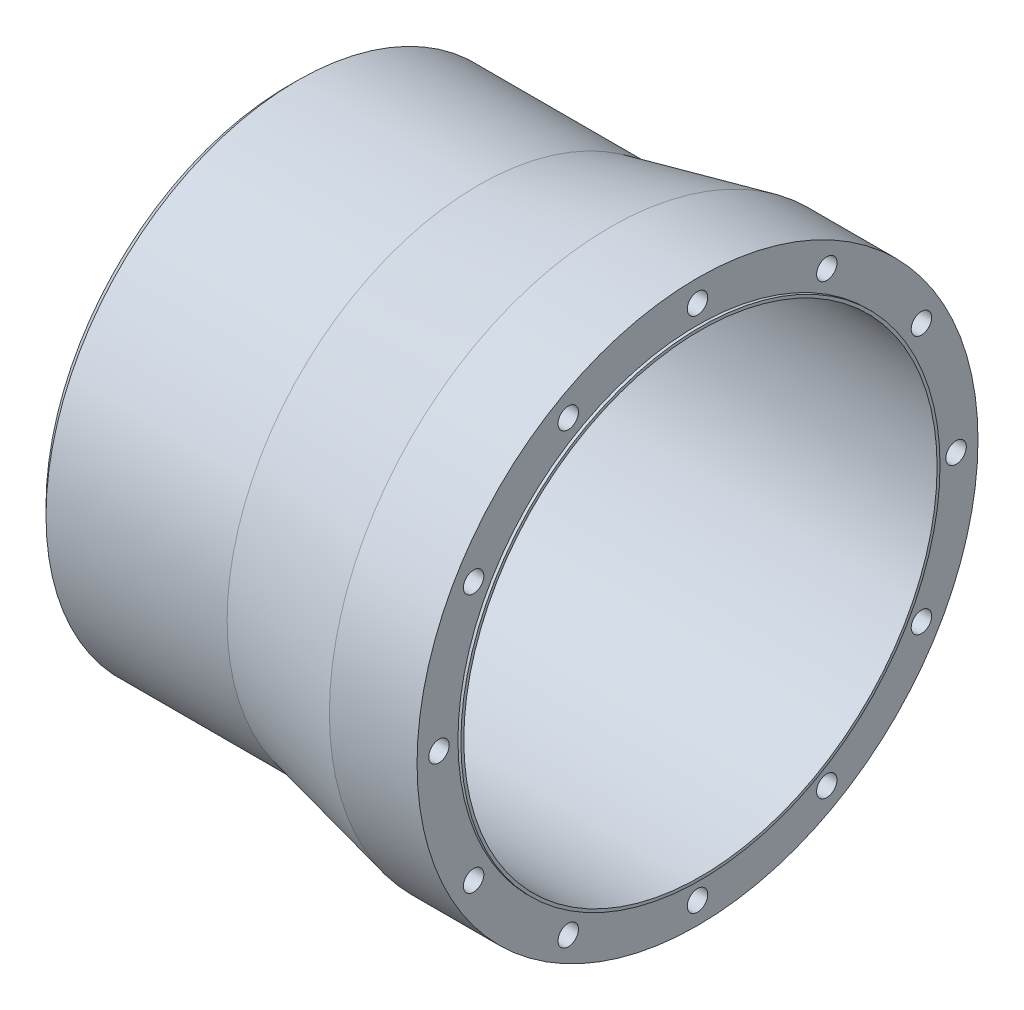
ISO-10303-21;
HEADER;
FILE_DESCRIPTION(('STEP AP214'),'2;1');
FILE_NAME('part.step','',(''),(''),'','','');
FILE_SCHEMA(('AUTOMOTIVE_DESIGN { 1 0 10303 214 1 1 1 1 }'));
ENDSEC;
DATA;
#1=APPLICATION_CONTEXT('core data for automotive mechanical design processes');
#2=APPLICATION_PROTOCOL_DEFINITION('international standard','automotive_design',2000,#1);
#3=PRODUCT_CONTEXT('',#1,'mechanical');
#4=PRODUCT('Part','Part','',(#3));
#5=PRODUCT_RELATED_PRODUCT_CATEGORY('part','',(#4));
#6=PRODUCT_DEFINITION_FORMATION('','',#4);
#7=PRODUCT_DEFINITION_CONTEXT('part definition',#1,'design');
#8=PRODUCT_DEFINITION('design','',#6,#7);
#9=PRODUCT_DEFINITION_SHAPE('','',#8);
#10=(LENGTH_UNIT() NAMED_UNIT(*) SI_UNIT(.MILLI.,.METRE.));
#11=(NAMED_UNIT(*) PLANE_ANGLE_UNIT() SI_UNIT($,.RADIAN.));
#12=(NAMED_UNIT(*) SI_UNIT($,.STERADIAN.) SOLID_ANGLE_UNIT());
#13=UNCERTAINTY_MEASURE_WITH_UNIT(LENGTH_MEASURE(1.E-05),#10,'distance_accuracy_value','');
#14=(GEOMETRIC_REPRESENTATION_CONTEXT(3) GLOBAL_UNCERTAINTY_ASSIGNED_CONTEXT((#13)) GLOBAL_UNIT_ASSIGNED_CONTEXT((#10,
#11,#12)) REPRESENTATION_CONTEXT('',''));
#15=CARTESIAN_POINT('',(0.,0.,0.));
#16=DIRECTION('',(0.,0.,1.));
#17=DIRECTION('',(1.,0.,0.));
#18=AXIS2_PLACEMENT_3D('',#15,#16,#17);
#19=CARTESIAN_POINT('',(150.,86.,0.));
#20=DIRECTION('',(-1.,0.,0.));
#21=DIRECTION('',(0.,0.,1.));
#22=AXIS2_PLACEMENT_3D('',#19,#20,#21);
#23=PLANE('',#22);
#24=CARTESIAN_POINT('',(150.,0.,0.));
#25=DIRECTION('',(-1.,0.,0.));
#26=DIRECTION('',(0.,0.,1.));
#27=AXIS2_PLACEMENT_3D('',#24,#25,#26);
#28=CIRCLE('',#27,96.);
#29=CARTESIAN_POINT('',(150.,0.,96.));
#30=VERTEX_POINT('',#29);
#31=EDGE_CURVE('E49',#30,#30,#28,.T.);
#32=ORIENTED_EDGE('',*,*,#31,.F.);
#33=EDGE_LOOP('',(#32));
#34=FACE_BOUND('',#33,.T.);
#35=CARTESIAN_POINT('',(150.,76.6432482349291,-44.2500000000017));
#36=DIRECTION('',(1.,0.,0.));
#37=DIRECTION('',(0.,0.,-1.));
#38=AXIS2_PLACEMENT_3D('',#35,#36,#37);
#39=CIRCLE('',#38,3.49999999999987);
#40=CARTESIAN_POINT('',(150.,76.6432482349291,-47.7500000000016));
#41=VERTEX_POINT('',#40);
#42=EDGE_CURVE('E64',#41,#41,#39,.T.);
#43=ORIENTED_EDGE('',*,*,#42,.F.);
#44=EDGE_LOOP('',(#43));
#45=FACE_BOUND('',#44,.T.);
#46=CARTESIAN_POINT('',(150.,88.5,0.));
#47=DIRECTION('',(1.,0.,0.));
#48=DIRECTION('',(0.,0.,-1.));
#49=AXIS2_PLACEMENT_3D('',#46,#47,#48);
#50=CIRCLE('',#49,3.5);
#51=CARTESIAN_POINT('',(150.,88.5,-3.5));
#52=VERTEX_POINT('',#51);
#53=EDGE_CURVE('E95',#52,#52,#50,.T.);
#54=ORIENTED_EDGE('',*,*,#53,.F.);
#55=EDGE_LOOP('',(#54));
#56=FACE_BOUND('',#55,.T.);
#57=CARTESIAN_POINT('',(150.,44.2500000000109,-76.6432482349291));
#58=DIRECTION('',(1.,0.,0.));
#59=DIRECTION('',(0.,0.,-1.));
#60=AXIS2_PLACEMENT_3D('',#57,#58,#59);
#61=CIRCLE('',#60,3.50000000000303);
#62=CARTESIAN_POINT('',(150.,44.2500000000109,-80.1432482349321));
#63=VERTEX_POINT('',#62);
#64=EDGE_CURVE('E89',#63,#63,#61,.T.);
#65=ORIENTED_EDGE('',*,*,#64,.F.);
#66=EDGE_LOOP('',(#65));
#67=FACE_BOUND('',#66,.T.);
#68=CARTESIAN_POINT('',(150.,1.25657682987813E-11,-88.5000000000125));
#69=DIRECTION('',(1.,0.,0.));
#70=DIRECTION('',(0.,0.,-1.));
#71=AXIS2_PLACEMENT_3D('',#68,#69,#70);
#72=CIRCLE('',#71,3.50000000000864);
#73=CARTESIAN_POINT('',(150.,1.25657682987813E-11,-92.0000000000212));
#74=VERTEX_POINT('',#73);
#75=EDGE_CURVE('E83',#74,#74,#72,.T.);
#76=ORIENTED_EDGE('',*,*,#75,.F.);
#77=EDGE_LOOP('',(#76));
#78=FACE_BOUND('',#77,.T.);
#79=CARTESIAN_POINT('',(150.,-44.2499999999891,-76.6432482349417));
#80=DIRECTION('',(1.,0.,0.));
#81=DIRECTION('',(0.,0.,-1.));
#82=AXIS2_PLACEMENT_3D('',#79,#80,#81);
#83=CIRCLE('',#82,3.50000000001525);
#84=CARTESIAN_POINT('',(150.,-44.2499999999891,-80.1432482349569));
#85=VERTEX_POINT('',#84);
#86=EDGE_CURVE('E77',#85,#85,#83,.T.);
#87=ORIENTED_EDGE('',*,*,#86,.F.);
#88=EDGE_LOOP('',(#87));
#89=FACE_BOUND('',#88,.T.);
#90=CARTESIAN_POINT('',(150.,-76.6432482349165,-44.2500000000235));
#91=DIRECTION('',(1.,0.,0.));
#92=DIRECTION('',(0.,0.,-1.));
#93=AXIS2_PLACEMENT_3D('',#90,#91,#92);
#94=CIRCLE('',#93,3.50000000002111);
#95=CARTESIAN_POINT('',(150.,-76.6432482349165,-47.7500000000446));
#96=VERTEX_POINT('',#95);
#97=EDGE_CURVE('E70',#96,#96,#94,.T.);
#98=ORIENTED_EDGE('',*,*,#97,.F.);
#99=EDGE_LOOP('',(#98));
#100=FACE_BOUND('',#99,.T.);
#101=CARTESIAN_POINT('',(150.,-88.5,-2.51315365975626E-11));
#102=DIRECTION('',(1.,0.,0.));
#103=DIRECTION('',(0.,0.,-1.));
#104=AXIS2_PLACEMENT_3D('',#101,#102,#103);
#105=CIRCLE('',#104,3.50000000002462);
#106=CARTESIAN_POINT('',(150.,-88.5,-3.50000000004975));
#107=VERTEX_POINT('',#106);
#108=EDGE_CURVE('E131',#107,#107,#105,.T.);
#109=ORIENTED_EDGE('',*,*,#108,.F.);
#110=EDGE_LOOP('',(#109));
#111=FACE_BOUND('',#110,.T.);
#112=CARTESIAN_POINT('',(150.,-76.6432482349291,44.2499999999765));
#113=DIRECTION('',(1.,0.,0.));
#114=DIRECTION('',(0.,0.,-1.));
#115=AXIS2_PLACEMENT_3D('',#112,#113,#114);
#116=CIRCLE('',#115,3.50000000002497);
#117=CARTESIAN_POINT('',(150.,-76.6432482349291,40.7499999999516));
#118=VERTEX_POINT('',#117);
#119=EDGE_CURVE('E125',#118,#118,#116,.T.);
#120=ORIENTED_EDGE('',*,*,#119,.F.);
#121=EDGE_LOOP('',(#120));
#122=FACE_BOUND('',#121,.T.);
#123=CARTESIAN_POINT('',(150.,-44.2500000000109,76.6432482349039));
#124=DIRECTION('',(1.,0.,0.));
#125=DIRECTION('',(0.,0.,-1.));
#126=AXIS2_PLACEMENT_3D('',#123,#124,#125);
#127=CIRCLE('',#126,3.50000000002204);
#128=CARTESIAN_POINT('',(150.,-44.2500000000109,73.1432482348819));
#129=VERTEX_POINT('',#128);
#130=EDGE_CURVE('E119',#129,#129,#127,.T.);
#131=ORIENTED_EDGE('',*,*,#130,.F.);
#132=EDGE_LOOP('',(#131));
#133=FACE_BOUND('',#132,.T.);
#134=CARTESIAN_POINT('',(150.,-1.25766064229538E-11,88.4999999999874));
#135=DIRECTION('',(1.,0.,0.));
#136=DIRECTION('',(0.,0.,-1.));
#137=AXIS2_PLACEMENT_3D('',#134,#135,#136);
#138=CIRCLE('',#137,3.50000000001658);
#139=CARTESIAN_POINT('',(150.,-1.25766064229538E-11,84.9999999999709));
#140=VERTEX_POINT('',#139);
#141=EDGE_CURVE('E113',#140,#140,#138,.T.);
#142=ORIENTED_EDGE('',*,*,#141,.F.);
#143=EDGE_LOOP('',(#142));
#144=FACE_BOUND('',#143,.T.);
#145=CARTESIAN_POINT('',(150.,44.2499999999891,76.6432482349166));
#146=DIRECTION('',(1.,0.,0.));
#147=DIRECTION('',(0.,0.,-1.));
#148=AXIS2_PLACEMENT_3D('',#145,#146,#147);
#149=CIRCLE('',#148,3.50000000001025);
#150=CARTESIAN_POINT('',(150.,44.2499999999891,73.1432482349063));
#151=VERTEX_POINT('',#150);
#152=EDGE_CURVE('E107',#151,#151,#149,.T.);
#153=ORIENTED_EDGE('',*,*,#152,.F.);
#154=EDGE_LOOP('',(#153));
#155=FACE_BOUND('',#154,.T.);
#156=CARTESIAN_POINT('',(150.,76.6432482349165,44.2499999999984));
#157=DIRECTION('',(1.,0.,0.));
#158=DIRECTION('',(0.,0.,-1.));
#159=AXIS2_PLACEMENT_3D('',#156,#157,#158);
#160=CIRCLE('',#159,3.50000000000459);
#161=CARTESIAN_POINT('',(150.,76.6432482349165,40.7499999999938));
#162=VERTEX_POINT('',#161);
#163=EDGE_CURVE('E100',#162,#162,#160,.T.);
#164=ORIENTED_EDGE('',*,*,#163,.F.);
#165=EDGE_LOOP('',(#164));
#166=FACE_BOUND('',#165,.T.);
#167=CARTESIAN_POINT('',(150.,0.,0.));
#168=DIRECTION('',(-1.,0.,0.));
#169=DIRECTION('',(0.,0.,1.));
#170=AXIS2_PLACEMENT_3D('',#167,#168,#169);
#171=CIRCLE('',#170,82.);
#172=CARTESIAN_POINT('',(150.,0.,82.));
#173=VERTEX_POINT('',#172);
#174=EDGE_CURVE('E10',#173,#173,#171,.F.);
#175=ORIENTED_EDGE('',*,*,#174,.F.);
#176=EDGE_LOOP('',(#175));
#177=FACE_BOUND('',#176,.T.);
#178=ADVANCED_FACE('F34',(#34,#45,#56,#67,#78,#89,#100,#111,#122,#133,#144,#155,#166,#177),#23,.F.);
#179=CARTESIAN_POINT('',(0.,0.,0.));
#180=DIRECTION('',(-1.,0.,0.));
#181=DIRECTION('',(0.,0.,1.));
#182=AXIS2_PLACEMENT_3D('',#179,#180,#181);
#183=CYLINDRICAL_SURFACE('',#182,96.);
#184=CARTESIAN_POINT('',(120.,0.,0.));
#185=DIRECTION('',(-1.,0.,0.));
#186=DIRECTION('',(0.,0.,1.));
#187=AXIS2_PLACEMENT_3D('',#184,#185,#186);
#188=CIRCLE('',#187,96.);
#189=CARTESIAN_POINT('',(120.,0.,96.));
#190=VERTEX_POINT('',#189);
#191=EDGE_CURVE('E54',#190,#190,#188,.T.);
#192=ORIENTED_EDGE('',*,*,#191,.F.);
#193=EDGE_LOOP('',(#192));
#194=FACE_BOUND('',#193,.T.);
#195=ORIENTED_EDGE('',*,*,#31,.T.);
#196=EDGE_LOOP('',(#195));
#197=FACE_BOUND('',#196,.T.);
#198=ADVANCED_FACE('F160',(#194,#197),#183,.T.);
#199=CARTESIAN_POINT('',(120.,0.,0.));
#200=DIRECTION('',(1.,0.,0.));
#201=DIRECTION('',(0.,0.,-1.));
#202=AXIS2_PLACEMENT_3D('',#199,#200,#201);
#203=CONICAL_SURFACE('',#202,96.,0.218668945873942);
#204=CARTESIAN_POINT('',(75.,0.,0.));
#205=DIRECTION('',(-1.,0.,0.));
#206=DIRECTION('',(0.,0.,1.));
#207=AXIS2_PLACEMENT_3D('',#204,#205,#206);
#208=CIRCLE('',#207,86.);
#209=CARTESIAN_POINT('',(75.,0.,86.));
#210=VERTEX_POINT('',#209);
#211=EDGE_CURVE('E57',#210,#210,#208,.T.);
#212=ORIENTED_EDGE('',*,*,#211,.F.);
#213=EDGE_LOOP('',(#212));
#214=FACE_BOUND('',#213,.T.);
#215=ORIENTED_EDGE('',*,*,#191,.T.);
#216=EDGE_LOOP('',(#215));
#217=FACE_BOUND('',#216,.T.);
#218=ADVANCED_FACE('F165',(#214,#217),#203,.T.);
#219=CARTESIAN_POINT('',(0.,0.,0.));
#220=DIRECTION('',(-1.,0.,0.));
#221=DIRECTION('',(0.,0.,1.));
#222=AXIS2_PLACEMENT_3D('',#219,#220,#221);
#223=CYLINDRICAL_SURFACE('',#222,86.);
#224=CARTESIAN_POINT('',(13.,0.,0.));
#225=DIRECTION('',(1.,0.,0.));
#226=DIRECTION('',(0.,0.,-1.));
#227=AXIS2_PLACEMENT_3D('',#224,#225,#226);
#228=CIRCLE('',#227,86.);
#229=CARTESIAN_POINT('',(13.,0.,-86.));
#230=VERTEX_POINT('',#229);
#231=EDGE_CURVE('E41',#230,#230,#228,.T.);
#232=ORIENTED_EDGE('',*,*,#231,.T.);
#233=EDGE_LOOP('',(#232));
#234=FACE_BOUND('',#233,.T.);
#235=ORIENTED_EDGE('',*,*,#211,.T.);
#236=EDGE_LOOP('',(#235));
#237=FACE_BOUND('',#236,.T.);
#238=ADVANCED_FACE('F173',(#234,#237),#223,.T.);
#239=CARTESIAN_POINT('',(10.,81.,0.));
#240=DIRECTION('',(1.,0.,0.));
#241=DIRECTION('',(0.,0.,-1.));
#242=AXIS2_PLACEMENT_3D('',#239,#240,#241);
#243=PLANE('',#242);
#244=CARTESIAN_POINT('',(10.,0.,0.));
#245=DIRECTION('',(1.,0.,0.));
#246=DIRECTION('',(0.,0.,-1.));
#247=AXIS2_PLACEMENT_3D('',#244,#245,#246);
#248=CIRCLE('',#247,83.);
#249=CARTESIAN_POINT('',(10.,0.,-83.));
#250=VERTEX_POINT('',#249);
#251=EDGE_CURVE('E45',#250,#250,#248,.F.);
#252=ORIENTED_EDGE('',*,*,#251,.T.);
#253=EDGE_LOOP('',(#252));
#254=FACE_BOUND('',#253,.T.);
#255=CARTESIAN_POINT('',(10.,0.,0.));
#256=DIRECTION('',(-1.,0.,0.));
#257=DIRECTION('',(0.,0.,1.));
#258=AXIS2_PLACEMENT_3D('',#255,#256,#257);
#259=CIRCLE('',#258,81.);
#260=CARTESIAN_POINT('',(10.,0.,81.));
#261=VERTEX_POINT('',#260);
#262=EDGE_CURVE('E60',#261,#261,#259,.T.);
#263=ORIENTED_EDGE('',*,*,#262,.F.);
#264=EDGE_LOOP('',(#263));
#265=FACE_BOUND('',#264,.T.);
#266=ADVANCED_FACE('F177',(#254,#265),#243,.F.);
#267=CARTESIAN_POINT('',(0.,0.,0.));
#268=DIRECTION('',(-1.,0.,0.));
#269=DIRECTION('',(0.,0.,1.));
#270=AXIS2_PLACEMENT_3D('',#267,#268,#269);
#271=CYLINDRICAL_SURFACE('',#270,81.);
#272=ORIENTED_EDGE('',*,*,#262,.T.);
#273=EDGE_LOOP('',(#272));
#274=FACE_BOUND('',#273,.T.);
#275=CARTESIAN_POINT('',(151.,0.,0.));
#276=DIRECTION('',(1.,0.,0.));
#277=DIRECTION('',(0.,0.,-1.));
#278=AXIS2_PLACEMENT_3D('',#275,#276,#277);
#279=CIRCLE('',#278,81.);
#280=CARTESIAN_POINT('',(151.,0.,-81.));
#281=VERTEX_POINT('',#280);
#282=EDGE_CURVE('E138',#281,#281,#279,.T.);
#283=ORIENTED_EDGE('',*,*,#282,.T.);
#284=EDGE_LOOP('',(#283));
#285=FACE_BOUND('',#284,.T.);
#286=ADVANCED_FACE('F142',(#274,#285),#271,.F.);
#287=CARTESIAN_POINT('',(10.,0.,0.));
#288=DIRECTION('',(1.,0.,0.));
#289=DIRECTION('',(0.,0.,-1.));
#290=AXIS2_PLACEMENT_3D('',#287,#288,#289);
#291=CONICAL_SURFACE('',#290,83.,0.785398163397446);
#292=CARTESIAN_POINT('',(13.,0.,-86.));
#293=CARTESIAN_POINT('',(12.96875,0.,-85.96875));
#294=CARTESIAN_POINT('',(12.9375,0.,-85.9375));
#295=CARTESIAN_POINT('',(12.875,0.,-85.875));
#296=CARTESIAN_POINT('',(12.84375,0.,-85.84375));
#297=CARTESIAN_POINT('',(12.78125,0.,-85.78125));
#298=CARTESIAN_POINT('',(12.75,0.,-85.75));
#299=CARTESIAN_POINT('',(12.6875,0.,-85.6875));
#300=CARTESIAN_POINT('',(12.65625,0.,-85.65625));
#301=CARTESIAN_POINT('',(12.59375,0.,-85.59375));
#302=CARTESIAN_POINT('',(12.5625,0.,-85.5625));
#303=CARTESIAN_POINT('',(12.5,0.,-85.5));
#304=CARTESIAN_POINT('',(12.46875,0.,-85.46875));
#305=CARTESIAN_POINT('',(12.40625,0.,-85.40625));
#306=CARTESIAN_POINT('',(12.375,0.,-85.375));
#307=CARTESIAN_POINT('',(12.3125,0.,-85.3125));
#308=CARTESIAN_POINT('',(12.28125,0.,-85.28125));
#309=CARTESIAN_POINT('',(12.21875,0.,-85.21875));
#310=CARTESIAN_POINT('',(12.1875,0.,-85.1875));
#311=CARTESIAN_POINT('',(12.125,0.,-85.125));
#312=CARTESIAN_POINT('',(12.09375,0.,-85.09375));
#313=CARTESIAN_POINT('',(12.03125,0.,-85.03125));
#314=CARTESIAN_POINT('',(12.,0.,-85.));
#315=CARTESIAN_POINT('',(11.9375,0.,-84.9375));
#316=CARTESIAN_POINT('',(11.90625,0.,-84.90625));
#317=CARTESIAN_POINT('',(11.84375,0.,-84.84375));
#318=CARTESIAN_POINT('',(11.8125,0.,-84.8125));
#319=CARTESIAN_POINT('',(11.75,0.,-84.75));
#320=CARTESIAN_POINT('',(11.71875,0.,-84.71875));
#321=CARTESIAN_POINT('',(11.65625,0.,-84.65625));
#322=CARTESIAN_POINT('',(11.625,0.,-84.625));
#323=CARTESIAN_POINT('',(11.5625,0.,-84.5625));
#324=CARTESIAN_POINT('',(11.53125,0.,-84.53125));
#325=CARTESIAN_POINT('',(11.46875,0.,-84.46875));
#326=CARTESIAN_POINT('',(11.4375,0.,-84.4375));
#327=CARTESIAN_POINT('',(11.375,0.,-84.375));
#328=CARTESIAN_POINT('',(11.34375,0.,-84.34375));
#329=CARTESIAN_POINT('',(11.28125,0.,-84.28125));
#330=CARTESIAN_POINT('',(11.25,0.,-84.25));
#331=CARTESIAN_POINT('',(11.1875,0.,-84.1875));
#332=CARTESIAN_POINT('',(11.15625,0.,-84.15625));
#333=CARTESIAN_POINT('',(11.09375,0.,-84.09375));
#334=CARTESIAN_POINT('',(11.0625,0.,-84.0625));
#335=CARTESIAN_POINT('',(11.,0.,-84.));
#336=CARTESIAN_POINT('',(10.96875,0.,-83.96875));
#337=CARTESIAN_POINT('',(10.90625,0.,-83.90625));
#338=CARTESIAN_POINT('',(10.875,0.,-83.875));
#339=CARTESIAN_POINT('',(10.8125,0.,-83.8125));
#340=CARTESIAN_POINT('',(10.78125,0.,-83.78125));
#341=CARTESIAN_POINT('',(10.71875,0.,-83.71875));
#342=CARTESIAN_POINT('',(10.6875,0.,-83.6875));
#343=CARTESIAN_POINT('',(10.625,0.,-83.625));
#344=CARTESIAN_POINT('',(10.59375,0.,-83.59375));
#345=CARTESIAN_POINT('',(10.53125,0.,-83.53125));
#346=CARTESIAN_POINT('',(10.5,0.,-83.5));
#347=CARTESIAN_POINT('',(10.4375,0.,-83.4375));
#348=CARTESIAN_POINT('',(10.40625,0.,-83.40625));
#349=CARTESIAN_POINT('',(10.34375,0.,-83.3437500000001));
#350=CARTESIAN_POINT('',(10.3125,0.,-83.3125));
#351=CARTESIAN_POINT('',(10.25,0.,-83.25));
#352=CARTESIAN_POINT('',(10.21875,0.,-83.21875));
#353=CARTESIAN_POINT('',(10.15625,0.,-83.15625));
#354=CARTESIAN_POINT('',(10.125,0.,-83.125));
#355=CARTESIAN_POINT('',(10.0625,0.,-83.0625000000001));
#356=CARTESIAN_POINT('',(10.03125,0.,-83.0312500000001));
#357=CARTESIAN_POINT('',(10.,0.,-83.));
#358=B_SPLINE_CURVE_WITH_KNOTS('',3,(#292,#293,#294,#295,#296,#297,#298,#299,#300,#301,#302,
#303,#304,#305,#306,#307,#308,#309,#310,#311,#312,#313,#314,#315,#316,#317,#318,#319,#320,#321,
#322,#323,#324,#325,#326,#327,#328,#329,#330,#331,#332,#333,#334,#335,#336,#337,#338,#339,#340,
#341,#342,#343,#344,#345,#346,#347,#348,#349,#350,#351,#352,#353,#354,#355,#356,#357),
.UNSPECIFIED.,.F.,.F.,(4,2,2,2,2,2,2,2,2,2,2,2,2,2,2,2,2,2,2,2,2,2,2,2,2,2,2,2,2,2,2,2,4),(0.,
0.13258252147248,0.265165042944949,0.39774756441743,0.530330085889909,0.662912607362379,
0.795495128834858,0.928077650307338,1.06066017177981,1.19324269325229,1.32582521472477,
1.45840773619724,1.59099025766972,1.7235727791422,1.85615530061467,1.98873782208715,
2.12132034355962,2.25390286503209,2.38648538650457,2.51906790797704,2.65165042944952,
2.784232950922,2.91681547239447,3.04939799386695,3.18198051533943,3.3145630368119,
3.44714555828438,3.57972807975686,3.71231060122933,3.84489312270181,3.97747564417429,
4.11005816564676,4.24264068711924),.UNSPECIFIED.);
#359=EDGE_CURVE('BSEAM36',#230,#250,#358,.T.);
#360=ORIENTED_EDGE('',*,*,#231,.F.);
#361=ORIENTED_EDGE('',*,*,#251,.F.);
#362=ORIENTED_EDGE('',*,*,#359,.T.);
#363=ORIENTED_EDGE('',*,*,#359,.F.);
#364=EDGE_LOOP('',(#360,#362,#361,#363));
#365=FACE_BOUND('',#364,.T.);
#366=ADVANCED_FACE('F36',(#365),#291,.T.);
#367=CARTESIAN_POINT('',(140.,76.6432482349291,-44.2500000000017));
#368=DIRECTION('',(1.,0.,0.));
#369=DIRECTION('',(0.,0.,-1.));
#370=AXIS2_PLACEMENT_3D('',#367,#368,#369);
#371=CYLINDRICAL_SURFACE('',#370,3.49999999999987);
#372=CARTESIAN_POINT('',(140.,76.6432482349291,-44.2500000000017));
#373=DIRECTION('',(1.,0.,0.));
#374=DIRECTION('',(0.,0.,-1.));
#375=AXIS2_PLACEMENT_3D('',#372,#373,#374);
#376=CIRCLE('',#375,3.49999999999987);
#377=CARTESIAN_POINT('',(140.,76.6432482349291,-47.7500000000016));
#378=VERTEX_POINT('',#377);
#379=EDGE_CURVE('E63',#378,#378,#376,.T.);
#380=ORIENTED_EDGE('',*,*,#379,.F.);
#381=EDGE_LOOP('',(#380));
#382=FACE_BOUND('',#381,.T.);
#383=ORIENTED_EDGE('',*,*,#42,.T.);
#384=EDGE_LOOP('',(#383));
#385=FACE_BOUND('',#384,.T.);
#386=ADVANCED_FACE('F184',(#382,#385),#371,.F.);
#387=CARTESIAN_POINT('',(140.,76.6432482349291,-44.2500000000017));
#388=DIRECTION('',(1.,0.,0.));
#389=DIRECTION('',(0.,0.,-1.));
#390=AXIS2_PLACEMENT_3D('',#387,#388,#389);
#391=PLANE('',#390);
#392=ORIENTED_EDGE('',*,*,#379,.T.);
#393=EDGE_LOOP('',(#392));
#394=FACE_BOUND('',#393,.T.);
#395=ADVANCED_FACE('F187',(#394),#391,.T.);
#396=CARTESIAN_POINT('',(140.,88.5,0.));
#397=DIRECTION('',(1.,0.,0.));
#398=DIRECTION('',(0.,0.,-1.));
#399=AXIS2_PLACEMENT_3D('',#396,#397,#398);
#400=CYLINDRICAL_SURFACE('',#399,3.5);
#401=CARTESIAN_POINT('',(140.,88.5,0.));
#402=DIRECTION('',(1.,0.,0.));
#403=DIRECTION('',(0.,0.,-1.));
#404=AXIS2_PLACEMENT_3D('',#401,#402,#403);
#405=CIRCLE('',#404,3.5);
#406=CARTESIAN_POINT('',(140.,88.5,-3.5));
#407=VERTEX_POINT('',#406);
#408=EDGE_CURVE('E67',#407,#407,#405,.T.);
#409=ORIENTED_EDGE('',*,*,#408,.F.);
#410=EDGE_LOOP('',(#409));
#411=FACE_BOUND('',#410,.T.);
#412=ORIENTED_EDGE('',*,*,#53,.T.);
#413=EDGE_LOOP('',(#412));
#414=FACE_BOUND('',#413,.T.);
#415=ADVANCED_FACE('F191',(#411,#414),#400,.F.);
#416=CARTESIAN_POINT('',(140.,88.5,0.));
#417=DIRECTION('',(1.,0.,0.));
#418=DIRECTION('',(0.,0.,-1.));
#419=AXIS2_PLACEMENT_3D('',#416,#417,#418);
#420=PLANE('',#419);
#421=ORIENTED_EDGE('',*,*,#408,.T.);
#422=EDGE_LOOP('',(#421));
#423=FACE_BOUND('',#422,.T.);
#424=ADVANCED_FACE('F222',(#423),#420,.T.);
#425=CARTESIAN_POINT('',(140.,44.2500000000109,-76.6432482349291));
#426=DIRECTION('',(1.,0.,0.));
#427=DIRECTION('',(0.,0.,-1.));
#428=AXIS2_PLACEMENT_3D('',#425,#426,#427);
#429=CYLINDRICAL_SURFACE('',#428,3.50000000000303);
#430=CARTESIAN_POINT('',(140.,44.2500000000109,-76.6432482349291));
#431=DIRECTION('',(1.,0.,0.));
#432=DIRECTION('',(0.,0.,-1.));
#433=AXIS2_PLACEMENT_3D('',#430,#431,#432);
#434=CIRCLE('',#433,3.50000000000303);
#435=CARTESIAN_POINT('',(140.,44.2500000000109,-80.1432482349321));
#436=VERTEX_POINT('',#435);
#437=EDGE_CURVE('E92',#436,#436,#434,.T.);
#438=ORIENTED_EDGE('',*,*,#437,.F.);
#439=EDGE_LOOP('',(#438));
#440=FACE_BOUND('',#439,.T.);
#441=ORIENTED_EDGE('',*,*,#64,.T.);
#442=EDGE_LOOP('',(#441));
#443=FACE_BOUND('',#442,.T.);
#444=ADVANCED_FACE('F219',(#440,#443),#429,.F.);
#445=CARTESIAN_POINT('',(140.,44.2500000000109,-76.6432482349291));
#446=DIRECTION('',(1.,0.,0.));
#447=DIRECTION('',(0.,0.,-1.));
#448=AXIS2_PLACEMENT_3D('',#445,#446,#447);
#449=PLANE('',#448);
#450=ORIENTED_EDGE('',*,*,#437,.T.);
#451=EDGE_LOOP('',(#450));
#452=FACE_BOUND('',#451,.T.);
#453=ADVANCED_FACE('F214',(#452),#449,.T.);
#454=CARTESIAN_POINT('',(140.,1.25657682987813E-11,-88.5000000000125));
#455=DIRECTION('',(1.,0.,0.));
#456=DIRECTION('',(0.,0.,-1.));
#457=AXIS2_PLACEMENT_3D('',#454,#455,#456);
#458=CYLINDRICAL_SURFACE('',#457,3.50000000000864);
#459=CARTESIAN_POINT('',(140.,1.25657682987813E-11,-88.5000000000125));
#460=DIRECTION('',(1.,0.,0.));
#461=DIRECTION('',(0.,0.,-1.));
#462=AXIS2_PLACEMENT_3D('',#459,#460,#461);
#463=CIRCLE('',#462,3.50000000000864);
#464=CARTESIAN_POINT('',(140.,1.25657682987813E-11,-92.0000000000212));
#465=VERTEX_POINT('',#464);
#466=EDGE_CURVE('E86',#465,#465,#463,.T.);
#467=ORIENTED_EDGE('',*,*,#466,.F.);
#468=EDGE_LOOP('',(#467));
#469=FACE_BOUND('',#468,.T.);
#470=ORIENTED_EDGE('',*,*,#75,.T.);
#471=EDGE_LOOP('',(#470));
#472=FACE_BOUND('',#471,.T.);
#473=ADVANCED_FACE('F211',(#469,#472),#458,.F.);
#474=CARTESIAN_POINT('',(140.,1.25657682987813E-11,-88.5000000000125));
#475=DIRECTION('',(1.,0.,0.));
#476=DIRECTION('',(0.,0.,-1.));
#477=AXIS2_PLACEMENT_3D('',#474,#475,#476);
#478=PLANE('',#477);
#479=ORIENTED_EDGE('',*,*,#466,.T.);
#480=EDGE_LOOP('',(#479));
#481=FACE_BOUND('',#480,.T.);
#482=ADVANCED_FACE('F206',(#481),#478,.T.);
#483=CARTESIAN_POINT('',(140.,-44.2499999999891,-76.6432482349417));
#484=DIRECTION('',(1.,0.,0.));
#485=DIRECTION('',(0.,0.,-1.));
#486=AXIS2_PLACEMENT_3D('',#483,#484,#485);
#487=CYLINDRICAL_SURFACE('',#486,3.50000000001525);
#488=CARTESIAN_POINT('',(140.,-44.2499999999891,-76.6432482349417));
#489=DIRECTION('',(1.,0.,0.));
#490=DIRECTION('',(0.,0.,-1.));
#491=AXIS2_PLACEMENT_3D('',#488,#489,#490);
#492=CIRCLE('',#491,3.50000000001525);
#493=CARTESIAN_POINT('',(140.,-44.2499999999891,-80.1432482349569));
#494=VERTEX_POINT('',#493);
#495=EDGE_CURVE('E80',#494,#494,#492,.T.);
#496=ORIENTED_EDGE('',*,*,#495,.F.);
#497=EDGE_LOOP('',(#496));
#498=FACE_BOUND('',#497,.T.);
#499=ORIENTED_EDGE('',*,*,#86,.T.);
#500=EDGE_LOOP('',(#499));
#501=FACE_BOUND('',#500,.T.);
#502=ADVANCED_FACE('F203',(#498,#501),#487,.F.);
#503=CARTESIAN_POINT('',(140.,-44.2499999999891,-76.6432482349417));
#504=DIRECTION('',(1.,0.,0.));
#505=DIRECTION('',(0.,0.,-1.));
#506=AXIS2_PLACEMENT_3D('',#503,#504,#505);
#507=PLANE('',#506);
#508=ORIENTED_EDGE('',*,*,#495,.T.);
#509=EDGE_LOOP('',(#508));
#510=FACE_BOUND('',#509,.T.);
#511=ADVANCED_FACE('F197',(#510),#507,.T.);
#512=CARTESIAN_POINT('',(140.,-76.6432482349165,-44.2500000000235));
#513=DIRECTION('',(1.,0.,0.));
#514=DIRECTION('',(0.,0.,-1.));
#515=AXIS2_PLACEMENT_3D('',#512,#513,#514);
#516=CYLINDRICAL_SURFACE('',#515,3.50000000002111);
#517=CARTESIAN_POINT('',(140.,-76.6432482349165,-44.2500000000235));
#518=DIRECTION('',(1.,0.,0.));
#519=DIRECTION('',(0.,0.,-1.));
#520=AXIS2_PLACEMENT_3D('',#517,#518,#519);
#521=CIRCLE('',#520,3.50000000002111);
#522=CARTESIAN_POINT('',(140.,-76.6432482349165,-47.7500000000446));
#523=VERTEX_POINT('',#522);
#524=EDGE_CURVE('E73',#523,#523,#521,.T.);
#525=ORIENTED_EDGE('',*,*,#524,.F.);
#526=EDGE_LOOP('',(#525));
#527=FACE_BOUND('',#526,.T.);
#528=ORIENTED_EDGE('',*,*,#97,.T.);
#529=EDGE_LOOP('',(#528));
#530=FACE_BOUND('',#529,.T.);
#531=ADVANCED_FACE('F193',(#527,#530),#516,.F.);
#532=CARTESIAN_POINT('',(140.,-76.6432482349165,-44.2500000000235));
#533=DIRECTION('',(1.,0.,0.));
#534=DIRECTION('',(0.,0.,-1.));
#535=AXIS2_PLACEMENT_3D('',#532,#533,#534);
#536=PLANE('',#535);
#537=ORIENTED_EDGE('',*,*,#524,.T.);
#538=EDGE_LOOP('',(#537));
#539=FACE_BOUND('',#538,.T.);
#540=ADVANCED_FACE('F196',(#539),#536,.T.);
#541=CARTESIAN_POINT('',(140.,-88.5,-2.51315365975626E-11));
#542=DIRECTION('',(1.,0.,0.));
#543=DIRECTION('',(0.,0.,-1.));
#544=AXIS2_PLACEMENT_3D('',#541,#542,#543);
#545=CYLINDRICAL_SURFACE('',#544,3.50000000002462);
#546=CARTESIAN_POINT('',(140.,-88.5,-2.51315365975626E-11));
#547=DIRECTION('',(1.,0.,0.));
#548=DIRECTION('',(0.,0.,-1.));
#549=AXIS2_PLACEMENT_3D('',#546,#547,#548);
#550=CIRCLE('',#549,3.50000000002462);
#551=CARTESIAN_POINT('',(140.,-88.5,-3.50000000004975));
#552=VERTEX_POINT('',#551);
#553=EDGE_CURVE('E74',#552,#552,#550,.T.);
#554=ORIENTED_EDGE('',*,*,#553,.F.);
#555=EDGE_LOOP('',(#554));
#556=FACE_BOUND('',#555,.T.);
#557=ORIENTED_EDGE('',*,*,#108,.T.);
#558=EDGE_LOOP('',(#557));
#559=FACE_BOUND('',#558,.T.);
#560=ADVANCED_FACE('F201',(#556,#559),#545,.F.);
#561=CARTESIAN_POINT('',(140.,-88.5,-2.51315365975626E-11));
#562=DIRECTION('',(1.,0.,0.));
#563=DIRECTION('',(0.,0.,-1.));
#564=AXIS2_PLACEMENT_3D('',#561,#562,#563);
#565=PLANE('',#564);
#566=ORIENTED_EDGE('',*,*,#553,.T.);
#567=EDGE_LOOP('',(#566));
#568=FACE_BOUND('',#567,.T.);
#569=ADVANCED_FACE('F264',(#568),#565,.T.);
#570=CARTESIAN_POINT('',(140.,-76.6432482349291,44.2499999999765));
#571=DIRECTION('',(1.,0.,0.));
#572=DIRECTION('',(0.,0.,-1.));
#573=AXIS2_PLACEMENT_3D('',#570,#571,#572);
#574=CYLINDRICAL_SURFACE('',#573,3.50000000002497);
#575=CARTESIAN_POINT('',(140.,-76.6432482349291,44.2499999999765));
#576=DIRECTION('',(1.,0.,0.));
#577=DIRECTION('',(0.,0.,-1.));
#578=AXIS2_PLACEMENT_3D('',#575,#576,#577);
#579=CIRCLE('',#578,3.50000000002497);
#580=CARTESIAN_POINT('',(140.,-76.6432482349291,40.7499999999516));
#581=VERTEX_POINT('',#580);
#582=EDGE_CURVE('E128',#581,#581,#579,.T.);
#583=ORIENTED_EDGE('',*,*,#582,.F.);
#584=EDGE_LOOP('',(#583));
#585=FACE_BOUND('',#584,.T.);
#586=ORIENTED_EDGE('',*,*,#119,.T.);
#587=EDGE_LOOP('',(#586));
#588=FACE_BOUND('',#587,.T.);
#589=ADVANCED_FACE('F261',(#585,#588),#574,.F.);
#590=CARTESIAN_POINT('',(140.,-76.6432482349291,44.2499999999765));
#591=DIRECTION('',(1.,0.,0.));
#592=DIRECTION('',(0.,0.,-1.));
#593=AXIS2_PLACEMENT_3D('',#590,#591,#592);
#594=PLANE('',#593);
#595=ORIENTED_EDGE('',*,*,#582,.T.);
#596=EDGE_LOOP('',(#595));
#597=FACE_BOUND('',#596,.T.);
#598=ADVANCED_FACE('F256',(#597),#594,.T.);
#599=CARTESIAN_POINT('',(140.,-44.2500000000109,76.6432482349039));
#600=DIRECTION('',(1.,0.,0.));
#601=DIRECTION('',(0.,0.,-1.));
#602=AXIS2_PLACEMENT_3D('',#599,#600,#601);
#603=CYLINDRICAL_SURFACE('',#602,3.50000000002204);
#604=CARTESIAN_POINT('',(140.,-44.2500000000109,76.6432482349039));
#605=DIRECTION('',(1.,0.,0.));
#606=DIRECTION('',(0.,0.,-1.));
#607=AXIS2_PLACEMENT_3D('',#604,#605,#606);
#608=CIRCLE('',#607,3.50000000002204);
#609=CARTESIAN_POINT('',(140.,-44.2500000000109,73.1432482348819));
#610=VERTEX_POINT('',#609);
#611=EDGE_CURVE('E122',#610,#610,#608,.T.);
#612=ORIENTED_EDGE('',*,*,#611,.F.);
#613=EDGE_LOOP('',(#612));
#614=FACE_BOUND('',#613,.T.);
#615=ORIENTED_EDGE('',*,*,#130,.T.);
#616=EDGE_LOOP('',(#615));
#617=FACE_BOUND('',#616,.T.);
#618=ADVANCED_FACE('F253',(#614,#617),#603,.F.);
#619=CARTESIAN_POINT('',(140.,-44.2500000000109,76.6432482349039));
#620=DIRECTION('',(1.,0.,0.));
#621=DIRECTION('',(0.,0.,-1.));
#622=AXIS2_PLACEMENT_3D('',#619,#620,#621);
#623=PLANE('',#622);
#624=ORIENTED_EDGE('',*,*,#611,.T.);
#625=EDGE_LOOP('',(#624));
#626=FACE_BOUND('',#625,.T.);
#627=ADVANCED_FACE('F248',(#626),#623,.T.);
#628=CARTESIAN_POINT('',(140.,-1.25766064229538E-11,88.4999999999874));
#629=DIRECTION('',(1.,0.,0.));
#630=DIRECTION('',(0.,0.,-1.));
#631=AXIS2_PLACEMENT_3D('',#628,#629,#630);
#632=CYLINDRICAL_SURFACE('',#631,3.50000000001658);
#633=CARTESIAN_POINT('',(140.,-1.25766064229538E-11,88.4999999999874));
#634=DIRECTION('',(1.,0.,0.));
#635=DIRECTION('',(0.,0.,-1.));
#636=AXIS2_PLACEMENT_3D('',#633,#634,#635);
#637=CIRCLE('',#636,3.50000000001658);
#638=CARTESIAN_POINT('',(140.,-1.25766064229538E-11,84.9999999999709));
#639=VERTEX_POINT('',#638);
#640=EDGE_CURVE('E116',#639,#639,#637,.T.);
#641=ORIENTED_EDGE('',*,*,#640,.F.);
#642=EDGE_LOOP('',(#641));
#643=FACE_BOUND('',#642,.T.);
#644=ORIENTED_EDGE('',*,*,#141,.T.);
#645=EDGE_LOOP('',(#644));
#646=FACE_BOUND('',#645,.T.);
#647=ADVANCED_FACE('F245',(#643,#646),#632,.F.);
#648=CARTESIAN_POINT('',(140.,-1.25766064229538E-11,88.4999999999874));
#649=DIRECTION('',(1.,0.,0.));
#650=DIRECTION('',(0.,0.,-1.));
#651=AXIS2_PLACEMENT_3D('',#648,#649,#650);
#652=PLANE('',#651);
#653=ORIENTED_EDGE('',*,*,#640,.T.);
#654=EDGE_LOOP('',(#653));
#655=FACE_BOUND('',#654,.T.);
#656=ADVANCED_FACE('F240',(#655),#652,.T.);
#657=CARTESIAN_POINT('',(140.,44.2499999999891,76.6432482349166));
#658=DIRECTION('',(1.,0.,0.));
#659=DIRECTION('',(0.,0.,-1.));
#660=AXIS2_PLACEMENT_3D('',#657,#658,#659);
#661=CYLINDRICAL_SURFACE('',#660,3.50000000001025);
#662=CARTESIAN_POINT('',(140.,44.2499999999891,76.6432482349166));
#663=DIRECTION('',(1.,0.,0.));
#664=DIRECTION('',(0.,0.,-1.));
#665=AXIS2_PLACEMENT_3D('',#662,#663,#664);
#666=CIRCLE('',#665,3.50000000001025);
#667=CARTESIAN_POINT('',(140.,44.2499999999891,73.1432482349063));
#668=VERTEX_POINT('',#667);
#669=EDGE_CURVE('E110',#668,#668,#666,.T.);
#670=ORIENTED_EDGE('',*,*,#669,.F.);
#671=EDGE_LOOP('',(#670));
#672=FACE_BOUND('',#671,.T.);
#673=ORIENTED_EDGE('',*,*,#152,.T.);
#674=EDGE_LOOP('',(#673));
#675=FACE_BOUND('',#674,.T.);
#676=ADVANCED_FACE('F237',(#672,#675),#661,.F.);
#677=CARTESIAN_POINT('',(140.,44.2499999999891,76.6432482349166));
#678=DIRECTION('',(1.,0.,0.));
#679=DIRECTION('',(0.,0.,-1.));
#680=AXIS2_PLACEMENT_3D('',#677,#678,#679);
#681=PLANE('',#680);
#682=ORIENTED_EDGE('',*,*,#669,.T.);
#683=EDGE_LOOP('',(#682));
#684=FACE_BOUND('',#683,.T.);
#685=ADVANCED_FACE('F234',(#684),#681,.T.);
#686=CARTESIAN_POINT('',(140.,76.6432482349165,44.2499999999984));
#687=DIRECTION('',(1.,0.,0.));
#688=DIRECTION('',(0.,0.,-1.));
#689=AXIS2_PLACEMENT_3D('',#686,#687,#688);
#690=CYLINDRICAL_SURFACE('',#689,3.50000000000459);
#691=CARTESIAN_POINT('',(140.,76.6432482349165,44.2499999999984));
#692=DIRECTION('',(1.,0.,0.));
#693=DIRECTION('',(0.,0.,-1.));
#694=AXIS2_PLACEMENT_3D('',#691,#692,#693);
#695=CIRCLE('',#694,3.50000000000459);
#696=CARTESIAN_POINT('',(140.,76.6432482349165,40.7499999999938));
#697=VERTEX_POINT('',#696);
#698=EDGE_CURVE('E103',#697,#697,#695,.T.);
#699=ORIENTED_EDGE('',*,*,#698,.F.);
#700=EDGE_LOOP('',(#699));
#701=FACE_BOUND('',#700,.T.);
#702=ORIENTED_EDGE('',*,*,#163,.T.);
#703=EDGE_LOOP('',(#702));
#704=FACE_BOUND('',#703,.T.);
#705=ADVANCED_FACE('F156',(#701,#704),#690,.F.);
#706=CARTESIAN_POINT('',(140.,76.6432482349165,44.2499999999984));
#707=DIRECTION('',(1.,0.,0.));
#708=DIRECTION('',(0.,0.,-1.));
#709=AXIS2_PLACEMENT_3D('',#706,#707,#708);
#710=PLANE('',#709);
#711=ORIENTED_EDGE('',*,*,#698,.T.);
#712=EDGE_LOOP('',(#711));
#713=FACE_BOUND('',#712,.T.);
#714=ADVANCED_FACE('F147',(#713),#710,.T.);
#715=CARTESIAN_POINT('',(151.,0.,0.));
#716=DIRECTION('',(1.,0.,0.));
#717=DIRECTION('',(0.,0.,-1.));
#718=AXIS2_PLACEMENT_3D('',#715,#716,#717);
#719=PLANE('',#718);
#720=CARTESIAN_POINT('',(151.,0.,0.));
#721=DIRECTION('',(1.,0.,0.));
#722=DIRECTION('',(0.,0.,-1.));
#723=AXIS2_PLACEMENT_3D('',#720,#721,#722);
#724=CIRCLE('',#723,82.);
#725=CARTESIAN_POINT('',(151.,0.,-82.));
#726=VERTEX_POINT('',#725);
#727=EDGE_CURVE('E104',#726,#726,#724,.T.);
#728=ORIENTED_EDGE('',*,*,#727,.T.);
#729=EDGE_LOOP('',(#728));
#730=FACE_BOUND('',#729,.T.);
#731=ORIENTED_EDGE('',*,*,#282,.F.);
#732=EDGE_LOOP('',(#731));
#733=FACE_BOUND('',#732,.T.);
#734=ADVANCED_FACE('F144',(#730,#733),#719,.T.);
#735=CARTESIAN_POINT('',(151.,0.,0.));
#736=DIRECTION('',(-1.,0.,0.));
#737=DIRECTION('',(0.,0.,1.));
#738=AXIS2_PLACEMENT_3D('',#735,#736,#737);
#739=CYLINDRICAL_SURFACE('',#738,82.);
#740=ORIENTED_EDGE('',*,*,#727,.F.);
#741=EDGE_LOOP('',(#740));
#742=FACE_BOUND('',#741,.T.);
#743=ORIENTED_EDGE('',*,*,#174,.T.);
#744=EDGE_LOOP('',(#743));
#745=FACE_BOUND('',#744,.T.);
#746=ADVANCED_FACE('F146',(#742,#745),#739,.T.);
#747=CLOSED_SHELL('',(#178,#198,#218,#238,#266,#286,#366,#386,#395,#415,#424,#444,#453,#473,
#482,#502,#511,#531,#540,#560,#569,#589,#598,#618,#627,#647,#656,#676,#685,#705,#714,#734,#746));
#748=MANIFOLD_SOLID_BREP('B2',#747);
#749=ADVANCED_BREP_SHAPE_REPRESENTATION('',(#18,#748),#14);
#750=SHAPE_DEFINITION_REPRESENTATION(#9,#749);
ENDSEC;
END-ISO-10303-21;
